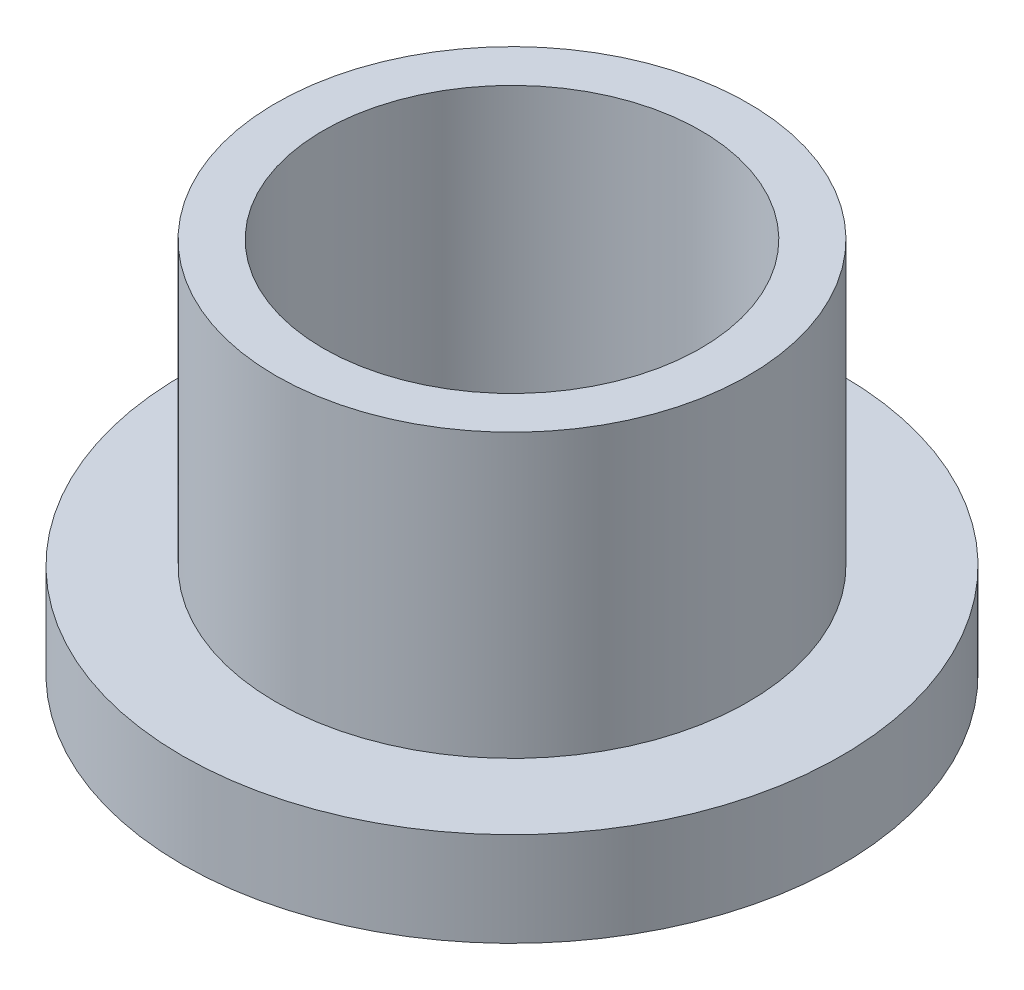
ISO-10303-21;
HEADER;
FILE_DESCRIPTION(('STEP AP214'),'2;1');
FILE_NAME('part.step','',(''),(''),'','','');
FILE_SCHEMA(('AUTOMOTIVE_DESIGN { 1 0 10303 214 1 1 1 1 }'));
ENDSEC;
DATA;
#1=APPLICATION_CONTEXT('core data for automotive mechanical design processes');
#2=APPLICATION_PROTOCOL_DEFINITION('international standard','automotive_design',2000,#1);
#3=PRODUCT_CONTEXT('',#1,'mechanical');
#4=PRODUCT('Part','Part','',(#3));
#5=PRODUCT_RELATED_PRODUCT_CATEGORY('part','',(#4));
#6=PRODUCT_DEFINITION_FORMATION('','',#4);
#7=PRODUCT_DEFINITION_CONTEXT('part definition',#1,'design');
#8=PRODUCT_DEFINITION('design','',#6,#7);
#9=PRODUCT_DEFINITION_SHAPE('','',#8);
#10=(LENGTH_UNIT() NAMED_UNIT(*) SI_UNIT(.MILLI.,.METRE.));
#11=(NAMED_UNIT(*) PLANE_ANGLE_UNIT() SI_UNIT($,.RADIAN.));
#12=(NAMED_UNIT(*) SI_UNIT($,.STERADIAN.) SOLID_ANGLE_UNIT());
#13=UNCERTAINTY_MEASURE_WITH_UNIT(LENGTH_MEASURE(1.E-05),#10,'distance_accuracy_value','');
#14=(GEOMETRIC_REPRESENTATION_CONTEXT(3) GLOBAL_UNCERTAINTY_ASSIGNED_CONTEXT((#13)) GLOBAL_UNIT_ASSIGNED_CONTEXT((#10,
#11,#12)) REPRESENTATION_CONTEXT('',''));
#15=CARTESIAN_POINT('',(0.,0.,0.));
#16=DIRECTION('',(0.,0.,1.));
#17=DIRECTION('',(1.,0.,0.));
#18=AXIS2_PLACEMENT_3D('',#15,#16,#17);
#19=CARTESIAN_POINT('',(0.,12.7,0.));
#20=DIRECTION('',(0.,1.,0.));
#21=DIRECTION('',(0.,0.,1.));
#22=AXIS2_PLACEMENT_3D('',#19,#20,#21);
#23=PLANE('',#22);
#24=CARTESIAN_POINT('',(0.,12.7,0.));
#25=DIRECTION('',(0.,1.,0.));
#26=DIRECTION('',(0.,0.,1.));
#27=AXIS2_PLACEMENT_3D('',#24,#25,#26);
#28=CIRCLE('',#27,7.9629);
#29=CARTESIAN_POINT('',(0.,12.7,7.9629));
#30=VERTEX_POINT('',#29);
#31=EDGE_CURVE('E10',#30,#30,#28,.T.);
#32=ORIENTED_EDGE('',*,*,#31,.T.);
#33=EDGE_LOOP('',(#32));
#34=FACE_BOUND('',#33,.T.);
#35=CARTESIAN_POINT('',(0.,12.7,0.));
#36=DIRECTION('',(0.,1.,0.));
#37=DIRECTION('',(0.,0.,1.));
#38=AXIS2_PLACEMENT_3D('',#35,#36,#37);
#39=CIRCLE('',#38,6.3627);
#40=CARTESIAN_POINT('',(0.,12.7,6.3627));
#41=VERTEX_POINT('',#40);
#42=EDGE_CURVE('E40',#41,#41,#39,.T.);
#43=ORIENTED_EDGE('',*,*,#42,.F.);
#44=EDGE_LOOP('',(#43));
#45=FACE_BOUND('',#44,.T.);
#46=ADVANCED_FACE('F33',(#34,#45),#23,.T.);
#47=CARTESIAN_POINT('',(0.,0.,0.));
#48=DIRECTION('',(0.,1.,0.));
#49=DIRECTION('',(0.,0.,1.));
#50=AXIS2_PLACEMENT_3D('',#47,#48,#49);
#51=PLANE('',#50);
#52=CARTESIAN_POINT('',(0.,0.,0.));
#53=DIRECTION('',(0.,1.,0.));
#54=DIRECTION('',(0.,0.,1.));
#55=AXIS2_PLACEMENT_3D('',#52,#53,#54);
#56=CIRCLE('',#55,6.3627);
#57=CARTESIAN_POINT('',(0.,0.,6.3627));
#58=VERTEX_POINT('',#57);
#59=EDGE_CURVE('E44',#58,#58,#56,.T.);
#60=ORIENTED_EDGE('',*,*,#59,.T.);
#61=EDGE_LOOP('',(#60));
#62=FACE_BOUND('',#61,.T.);
#63=CARTESIAN_POINT('',(0.,0.,0.));
#64=DIRECTION('',(0.,1.,0.));
#65=DIRECTION('',(0.,0.,1.));
#66=AXIS2_PLACEMENT_3D('',#63,#64,#65);
#67=CIRCLE('',#66,11.1125);
#68=CARTESIAN_POINT('',(0.,0.,11.1125));
#69=VERTEX_POINT('',#68);
#70=EDGE_CURVE('E51',#69,#69,#67,.T.);
#71=ORIENTED_EDGE('',*,*,#70,.F.);
#72=EDGE_LOOP('',(#71));
#73=FACE_BOUND('',#72,.T.);
#74=ADVANCED_FACE('F76',(#62,#73),#51,.F.);
#75=CARTESIAN_POINT('',(0.,12.7,0.));
#76=DIRECTION('',(0.,-1.,0.));
#77=DIRECTION('',(0.,0.,-1.));
#78=AXIS2_PLACEMENT_3D('',#75,#76,#77);
#79=CYLINDRICAL_SURFACE('',#78,7.9629);
#80=CARTESIAN_POINT('',(0.,3.175,0.));
#81=DIRECTION('',(0.,1.,0.));
#82=DIRECTION('',(0.,0.,1.));
#83=AXIS2_PLACEMENT_3D('',#80,#81,#82);
#84=CIRCLE('',#83,7.9629);
#85=CARTESIAN_POINT('',(0.,3.175,7.9629));
#86=VERTEX_POINT('',#85);
#87=EDGE_CURVE('E54',#86,#86,#84,.T.);
#88=ORIENTED_EDGE('',*,*,#87,.T.);
#89=EDGE_LOOP('',(#88));
#90=FACE_BOUND('',#89,.T.);
#91=ORIENTED_EDGE('',*,*,#31,.F.);
#92=EDGE_LOOP('',(#91));
#93=FACE_BOUND('',#92,.T.);
#94=ADVANCED_FACE('F35',(#90,#93),#79,.T.);
#95=CARTESIAN_POINT('',(0.,12.7,0.));
#96=DIRECTION('',(0.,-1.,0.));
#97=DIRECTION('',(0.,0.,-1.));
#98=AXIS2_PLACEMENT_3D('',#95,#96,#97);
#99=CYLINDRICAL_SURFACE('',#98,6.3627);
#100=ORIENTED_EDGE('',*,*,#42,.T.);
#101=EDGE_LOOP('',(#100));
#102=FACE_BOUND('',#101,.T.);
#103=ORIENTED_EDGE('',*,*,#59,.F.);
#104=EDGE_LOOP('',(#103));
#105=FACE_BOUND('',#104,.T.);
#106=ADVANCED_FACE('F65',(#102,#105),#99,.F.);
#107=CARTESIAN_POINT('',(0.,3.175,0.));
#108=DIRECTION('',(0.,1.,0.));
#109=DIRECTION('',(0.,0.,1.));
#110=AXIS2_PLACEMENT_3D('',#107,#108,#109);
#111=PLANE('',#110);
#112=CARTESIAN_POINT('',(0.,3.175,0.));
#113=DIRECTION('',(0.,1.,0.));
#114=DIRECTION('',(0.,0.,1.));
#115=AXIS2_PLACEMENT_3D('',#112,#113,#114);
#116=CIRCLE('',#115,11.1125);
#117=CARTESIAN_POINT('',(0.,3.175,11.1125));
#118=VERTEX_POINT('',#117);
#119=EDGE_CURVE('E49',#118,#118,#116,.T.);
#120=ORIENTED_EDGE('',*,*,#119,.T.);
#121=EDGE_LOOP('',(#120));
#122=FACE_BOUND('',#121,.T.);
#123=ORIENTED_EDGE('',*,*,#87,.F.);
#124=EDGE_LOOP('',(#123));
#125=FACE_BOUND('',#124,.T.);
#126=ADVANCED_FACE('F62',(#122,#125),#111,.T.);
#127=CARTESIAN_POINT('',(0.,3.175,0.));
#128=DIRECTION('',(0.,-1.,0.));
#129=DIRECTION('',(0.,0.,-1.));
#130=AXIS2_PLACEMENT_3D('',#127,#128,#129);
#131=CYLINDRICAL_SURFACE('',#130,11.1125);
#132=ORIENTED_EDGE('',*,*,#119,.F.);
#133=EDGE_LOOP('',(#132));
#134=FACE_BOUND('',#133,.T.);
#135=ORIENTED_EDGE('',*,*,#70,.T.);
#136=EDGE_LOOP('',(#135));
#137=FACE_BOUND('',#136,.T.);
#138=ADVANCED_FACE('F64',(#134,#137),#131,.T.);
#139=CLOSED_SHELL('',(#46,#74,#94,#106,#126,#138));
#140=MANIFOLD_SOLID_BREP('B2',#139);
#141=ADVANCED_BREP_SHAPE_REPRESENTATION('',(#18,#140),#14);
#142=SHAPE_DEFINITION_REPRESENTATION(#9,#141);
ENDSEC;
END-ISO-10303-21;
